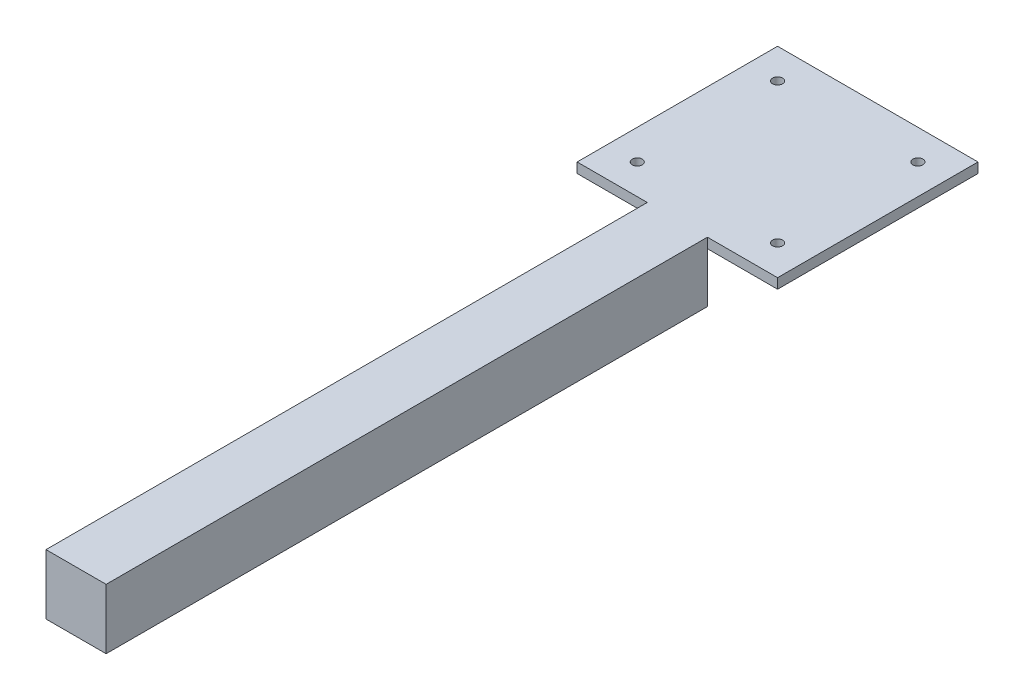
ISO-10303-21;
HEADER;
FILE_DESCRIPTION(('STEP AP214'),'2;1');
FILE_NAME('part.step','',(''),(''),'','','');
FILE_SCHEMA(('AUTOMOTIVE_DESIGN { 1 0 10303 214 1 1 1 1 }'));
ENDSEC;
DATA;
#1=APPLICATION_CONTEXT('core data for automotive mechanical design processes');
#2=APPLICATION_PROTOCOL_DEFINITION('international standard','automotive_design',2000,#1);
#3=PRODUCT_CONTEXT('',#1,'mechanical');
#4=PRODUCT('Part','Part','',(#3));
#5=PRODUCT_RELATED_PRODUCT_CATEGORY('part','',(#4));
#6=PRODUCT_DEFINITION_FORMATION('','',#4);
#7=PRODUCT_DEFINITION_CONTEXT('part definition',#1,'design');
#8=PRODUCT_DEFINITION('design','',#6,#7);
#9=PRODUCT_DEFINITION_SHAPE('','',#8);
#10=(LENGTH_UNIT() NAMED_UNIT(*) SI_UNIT(.MILLI.,.METRE.));
#11=(NAMED_UNIT(*) PLANE_ANGLE_UNIT() SI_UNIT($,.RADIAN.));
#12=(NAMED_UNIT(*) SI_UNIT($,.STERADIAN.) SOLID_ANGLE_UNIT());
#13=UNCERTAINTY_MEASURE_WITH_UNIT(LENGTH_MEASURE(1.E-05),#10,'distance_accuracy_value','');
#14=(GEOMETRIC_REPRESENTATION_CONTEXT(3) GLOBAL_UNCERTAINTY_ASSIGNED_CONTEXT((#13)) GLOBAL_UNIT_ASSIGNED_CONTEXT((#10,
#11,#12)) REPRESENTATION_CONTEXT('',''));
#15=CARTESIAN_POINT('',(0.,0.,0.));
#16=DIRECTION('',(0.,0.,1.));
#17=DIRECTION('',(1.,0.,0.));
#18=AXIS2_PLACEMENT_3D('',#15,#16,#17);
#19=CARTESIAN_POINT('',(-15.,-15.,300.));
#20=DIRECTION('',(1.,0.,0.));
#21=DIRECTION('',(0.,0.,-1.));
#22=AXIS2_PLACEMENT_3D('',#19,#20,#21);
#23=PLANE('',#22);
#24=DIRECTION('',(0.,-1.,0.));
#25=VECTOR('',#24,1.);
#26=CARTESIAN_POINT('',(-15.,-15.,0.));
#27=LINE('',#26,#25);
#28=CARTESIAN_POINT('',(-15.,15.,0.));
#29=VERTEX_POINT('',#28);
#30=CARTESIAN_POINT('',(-15.,9.99999999999999,0.));
#31=VERTEX_POINT('',#30);
#32=EDGE_CURVE('E190',#29,#31,#27,.T.);
#33=ORIENTED_EDGE('',*,*,#32,.T.);
#34=CARTESIAN_POINT('',(-15.,-15.,0.));
#35=VERTEX_POINT('',#34);
#36=EDGE_CURVE('E171',#31,#35,#27,.T.);
#37=ORIENTED_EDGE('',*,*,#36,.T.);
#38=DIRECTION('',(0.,0.,-1.));
#39=VECTOR('',#38,1.);
#40=CARTESIAN_POINT('',(-15.,-15.,300.));
#41=LINE('',#40,#39);
#42=CARTESIAN_POINT('',(-15.,-15.,300.));
#43=VERTEX_POINT('',#42);
#44=EDGE_CURVE('E41',#43,#35,#41,.T.);
#45=ORIENTED_EDGE('',*,*,#44,.F.);
#46=DIRECTION('',(0.,-1.,0.));
#47=VECTOR('',#46,1.);
#48=CARTESIAN_POINT('',(-15.,-15.,300.));
#49=LINE('',#48,#47);
#50=CARTESIAN_POINT('',(-15.,15.,300.));
#51=VERTEX_POINT('',#50);
#52=EDGE_CURVE('E178',#51,#43,#49,.T.);
#53=ORIENTED_EDGE('',*,*,#52,.F.);
#54=DIRECTION('',(0.,0.,-1.));
#55=VECTOR('',#54,1.);
#56=CARTESIAN_POINT('',(-15.,15.,300.));
#57=LINE('',#56,#55);
#58=EDGE_CURVE('E189',#51,#29,#57,.T.);
#59=ORIENTED_EDGE('',*,*,#58,.T.);
#60=EDGE_LOOP('',(#33,#37,#45,#53,#59));
#61=FACE_BOUND('',#60,.T.);
#62=ADVANCED_FACE('F38',(#61),#23,.F.);
#63=CARTESIAN_POINT('',(15.,-15.,300.));
#64=DIRECTION('',(0.,1.,0.));
#65=DIRECTION('',(-1.,0.,0.));
#66=AXIS2_PLACEMENT_3D('',#63,#64,#65);
#67=PLANE('',#66);
#68=DIRECTION('',(1.,0.,0.));
#69=VECTOR('',#68,1.);
#70=CARTESIAN_POINT('',(15.,-15.,0.));
#71=LINE('',#70,#69);
#72=CARTESIAN_POINT('',(15.,-15.,0.));
#73=VERTEX_POINT('',#72);
#74=EDGE_CURVE('E80',#35,#73,#71,.T.);
#75=ORIENTED_EDGE('',*,*,#74,.T.);
#76=DIRECTION('',(0.,0.,-1.));
#77=VECTOR('',#76,1.);
#78=CARTESIAN_POINT('',(15.,-15.,300.));
#79=LINE('',#78,#77);
#80=CARTESIAN_POINT('',(15.,-15.,300.));
#81=VERTEX_POINT('',#80);
#82=EDGE_CURVE('E206',#81,#73,#79,.T.);
#83=ORIENTED_EDGE('',*,*,#82,.F.);
#84=DIRECTION('',(1.,0.,0.));
#85=VECTOR('',#84,1.);
#86=CARTESIAN_POINT('',(15.,-15.,300.));
#87=LINE('',#86,#85);
#88=EDGE_CURVE('E85',#43,#81,#87,.T.);
#89=ORIENTED_EDGE('',*,*,#88,.F.);
#90=ORIENTED_EDGE('',*,*,#44,.T.);
#91=EDGE_LOOP('',(#75,#83,#89,#90));
#92=FACE_BOUND('',#91,.T.);
#93=ADVANCED_FACE('F213',(#92),#67,.F.);
#94=CARTESIAN_POINT('',(15.,-15.,300.));
#95=DIRECTION('',(-1.,0.,0.));
#96=DIRECTION('',(0.,0.,1.));
#97=AXIS2_PLACEMENT_3D('',#94,#95,#96);
#98=PLANE('',#97);
#99=DIRECTION('',(0.,1.,0.));
#100=VECTOR('',#99,1.);
#101=CARTESIAN_POINT('',(15.,-15.,0.));
#102=LINE('',#101,#100);
#103=CARTESIAN_POINT('',(15.,9.99999999999999,0.));
#104=VERTEX_POINT('',#103);
#105=EDGE_CURVE('E181',#73,#104,#102,.T.);
#106=ORIENTED_EDGE('',*,*,#105,.T.);
#107=CARTESIAN_POINT('',(15.,15.,0.));
#108=VERTEX_POINT('',#107);
#109=EDGE_CURVE('E196',#104,#108,#102,.T.);
#110=ORIENTED_EDGE('',*,*,#109,.T.);
#111=DIRECTION('',(0.,0.,-1.));
#112=VECTOR('',#111,1.);
#113=CARTESIAN_POINT('',(15.,15.,300.));
#114=LINE('',#113,#112);
#115=CARTESIAN_POINT('',(15.,15.,300.));
#116=VERTEX_POINT('',#115);
#117=EDGE_CURVE('E203',#116,#108,#114,.T.);
#118=ORIENTED_EDGE('',*,*,#117,.F.);
#119=DIRECTION('',(0.,1.,0.));
#120=VECTOR('',#119,1.);
#121=CARTESIAN_POINT('',(15.,-15.,300.));
#122=LINE('',#121,#120);
#123=EDGE_CURVE('E184',#81,#116,#122,.T.);
#124=ORIENTED_EDGE('',*,*,#123,.F.);
#125=ORIENTED_EDGE('',*,*,#82,.T.);
#126=EDGE_LOOP('',(#106,#110,#118,#124,#125));
#127=FACE_BOUND('',#126,.T.);
#128=ADVANCED_FACE('F220',(#127),#98,.F.);
#129=CARTESIAN_POINT('',(15.,15.,300.));
#130=DIRECTION('',(0.,-1.,0.));
#131=DIRECTION('',(1.,0.,0.));
#132=AXIS2_PLACEMENT_3D('',#129,#130,#131);
#133=PLANE('',#132);
#134=CARTESIAN_POINT('',(35.,15.,-15.));
#135=DIRECTION('',(0.,1.,0.));
#136=DIRECTION('',(1.,0.,0.));
#137=AXIS2_PLACEMENT_3D('',#134,#135,#136);
#138=CIRCLE('',#137,2.5);
#139=CARTESIAN_POINT('',(37.5,15.,-15.));
#140=VERTEX_POINT('',#139);
#141=EDGE_CURVE('E240',#140,#140,#138,.T.);
#142=ORIENTED_EDGE('',*,*,#141,.F.);
#143=EDGE_LOOP('',(#142));
#144=FACE_BOUND('',#143,.T.);
#145=CARTESIAN_POINT('',(-35.,15.,-85.));
#146=DIRECTION('',(0.,1.,0.));
#147=DIRECTION('',(1.,0.,0.));
#148=AXIS2_PLACEMENT_3D('',#145,#146,#147);
#149=CIRCLE('',#148,2.5);
#150=CARTESIAN_POINT('',(-32.5,15.,-85.));
#151=VERTEX_POINT('',#150);
#152=EDGE_CURVE('E247',#151,#151,#149,.T.);
#153=ORIENTED_EDGE('',*,*,#152,.F.);
#154=EDGE_LOOP('',(#153));
#155=FACE_BOUND('',#154,.T.);
#156=CARTESIAN_POINT('',(35.,15.,-85.));
#157=DIRECTION('',(0.,1.,0.));
#158=DIRECTION('',(-1.,0.,0.));
#159=AXIS2_PLACEMENT_3D('',#156,#157,#158);
#160=CIRCLE('',#159,2.5);
#161=CARTESIAN_POINT('',(32.5,15.,-85.));
#162=VERTEX_POINT('',#161);
#163=EDGE_CURVE('E255',#162,#162,#160,.T.);
#164=ORIENTED_EDGE('',*,*,#163,.F.);
#165=EDGE_LOOP('',(#164));
#166=FACE_BOUND('',#165,.T.);
#167=CARTESIAN_POINT('',(-35.,15.,-15.));
#168=DIRECTION('',(0.,1.,0.));
#169=DIRECTION('',(-1.,0.,0.));
#170=AXIS2_PLACEMENT_3D('',#167,#168,#169);
#171=CIRCLE('',#170,2.5);
#172=CARTESIAN_POINT('',(-37.5,15.,-15.));
#173=VERTEX_POINT('',#172);
#174=EDGE_CURVE('E163',#173,#173,#171,.T.);
#175=ORIENTED_EDGE('',*,*,#174,.F.);
#176=EDGE_LOOP('',(#175));
#177=FACE_BOUND('',#176,.T.);
#178=ORIENTED_EDGE('',*,*,#117,.T.);
#179=DIRECTION('',(1.,0.,0.));
#180=VECTOR('',#179,1.);
#181=CARTESIAN_POINT('',(-50.,15.,0.));
#182=LINE('',#181,#180);
#183=CARTESIAN_POINT('',(50.,15.,0.));
#184=VERTEX_POINT('',#183);
#185=EDGE_CURVE('E162',#108,#184,#182,.T.);
#186=ORIENTED_EDGE('',*,*,#185,.T.);
#187=DIRECTION('',(0.,0.,-1.));
#188=VECTOR('',#187,1.);
#189=CARTESIAN_POINT('',(50.,15.,0.));
#190=LINE('',#189,#188);
#191=CARTESIAN_POINT('',(50.,15.,-100.));
#192=VERTEX_POINT('',#191);
#193=EDGE_CURVE('E148',#184,#192,#190,.T.);
#194=ORIENTED_EDGE('',*,*,#193,.T.);
#195=DIRECTION('',(-1.,0.,0.));
#196=VECTOR('',#195,1.);
#197=CARTESIAN_POINT('',(-50.,15.,-100.));
#198=LINE('',#197,#196);
#199=CARTESIAN_POINT('',(-50.,15.,-100.));
#200=VERTEX_POINT('',#199);
#201=EDGE_CURVE('E143',#192,#200,#198,.T.);
#202=ORIENTED_EDGE('',*,*,#201,.T.);
#203=DIRECTION('',(0.,0.,1.));
#204=VECTOR('',#203,1.);
#205=CARTESIAN_POINT('',(-50.,15.,0.));
#206=LINE('',#205,#204);
#207=CARTESIAN_POINT('',(-50.,15.,0.));
#208=VERTEX_POINT('',#207);
#209=EDGE_CURVE('E159',#200,#208,#206,.T.);
#210=ORIENTED_EDGE('',*,*,#209,.T.);
#211=EDGE_CURVE('E124',#208,#29,#182,.T.);
#212=ORIENTED_EDGE('',*,*,#211,.T.);
#213=ORIENTED_EDGE('',*,*,#58,.F.);
#214=DIRECTION('',(-1.,0.,0.));
#215=VECTOR('',#214,1.);
#216=CARTESIAN_POINT('',(15.,15.,300.));
#217=LINE('',#216,#215);
#218=EDGE_CURVE('E64',#116,#51,#217,.T.);
#219=ORIENTED_EDGE('',*,*,#218,.F.);
#220=EDGE_LOOP('',(#178,#186,#194,#202,#210,#212,#213,#219));
#221=FACE_BOUND('',#220,.T.);
#222=ADVANCED_FACE('F225',(#144,#155,#166,#177,#221),#133,.F.);
#223=CARTESIAN_POINT('',(0.,0.,300.));
#224=DIRECTION('',(0.,0.,1.));
#225=DIRECTION('',(1.,0.,0.));
#226=AXIS2_PLACEMENT_3D('',#223,#224,#225);
#227=PLANE('',#226);
#228=ORIENTED_EDGE('',*,*,#52,.T.);
#229=ORIENTED_EDGE('',*,*,#88,.T.);
#230=ORIENTED_EDGE('',*,*,#123,.T.);
#231=ORIENTED_EDGE('',*,*,#218,.T.);
#232=EDGE_LOOP('',(#228,#229,#230,#231));
#233=FACE_BOUND('',#232,.T.);
#234=ADVANCED_FACE('F277',(#233),#227,.T.);
#235=CARTESIAN_POINT('',(0.,0.,0.));
#236=DIRECTION('',(0.,0.,1.));
#237=DIRECTION('',(1.,0.,0.));
#238=AXIS2_PLACEMENT_3D('',#235,#236,#237);
#239=PLANE('',#238);
#240=ORIENTED_EDGE('',*,*,#36,.F.);
#241=DIRECTION('',(1.,0.,0.));
#242=VECTOR('',#241,1.);
#243=CARTESIAN_POINT('',(-50.,9.99999999999999,0.));
#244=LINE('',#243,#242);
#245=EDGE_CURVE('E11',#31,#104,#244,.T.);
#246=ORIENTED_EDGE('',*,*,#245,.T.);
#247=ORIENTED_EDGE('',*,*,#105,.F.);
#248=ORIENTED_EDGE('',*,*,#74,.F.);
#249=EDGE_LOOP('',(#240,#246,#247,#248));
#250=FACE_BOUND('',#249,.T.);
#251=ADVANCED_FACE('F218',(#250),#239,.F.);
#252=CARTESIAN_POINT('',(-50.,9.99999999999999,0.));
#253=DIRECTION('',(0.,0.,1.));
#254=DIRECTION('',(1.,0.,0.));
#255=AXIS2_PLACEMENT_3D('',#252,#253,#254);
#256=PLANE('',#255);
#257=ORIENTED_EDGE('',*,*,#32,.F.);
#258=ORIENTED_EDGE('',*,*,#211,.F.);
#259=DIRECTION('',(0.,1.,0.));
#260=VECTOR('',#259,1.);
#261=CARTESIAN_POINT('',(-50.,9.99999999999999,0.));
#262=LINE('',#261,#260);
#263=CARTESIAN_POINT('',(-50.,9.99999999999999,0.));
#264=VERTEX_POINT('',#263);
#265=EDGE_CURVE('E119',#264,#208,#262,.T.);
#266=ORIENTED_EDGE('',*,*,#265,.F.);
#267=EDGE_CURVE('E48',#264,#31,#244,.T.);
#268=ORIENTED_EDGE('',*,*,#267,.T.);
#269=EDGE_LOOP('',(#257,#258,#266,#268));
#270=FACE_BOUND('',#269,.T.);
#271=ADVANCED_FACE('F121',(#270),#256,.T.);
#272=ORIENTED_EDGE('',*,*,#109,.F.);
#273=CARTESIAN_POINT('',(50.,10.,0.));
#274=VERTEX_POINT('',#273);
#275=EDGE_CURVE('E49',#104,#274,#244,.T.);
#276=ORIENTED_EDGE('',*,*,#275,.T.);
#277=DIRECTION('',(0.,1.,0.));
#278=VECTOR('',#277,1.);
#279=CARTESIAN_POINT('',(50.,10.,0.));
#280=LINE('',#279,#278);
#281=EDGE_CURVE('E130',#274,#184,#280,.T.);
#282=ORIENTED_EDGE('',*,*,#281,.T.);
#283=ORIENTED_EDGE('',*,*,#185,.F.);
#284=EDGE_LOOP('',(#272,#276,#282,#283));
#285=FACE_BOUND('',#284,.T.);
#286=ADVANCED_FACE('F233',(#285),#256,.T.);
#287=CARTESIAN_POINT('',(-50.,9.99999999999999,0.));
#288=DIRECTION('',(-1.,0.,0.));
#289=DIRECTION('',(0.,-1.,0.));
#290=AXIS2_PLACEMENT_3D('',#287,#288,#289);
#291=PLANE('',#290);
#292=ORIENTED_EDGE('',*,*,#209,.F.);
#293=DIRECTION('',(0.,1.,0.));
#294=VECTOR('',#293,1.);
#295=CARTESIAN_POINT('',(-50.,9.99999999999999,-100.));
#296=LINE('',#295,#294);
#297=CARTESIAN_POINT('',(-50.,9.99999999999999,-100.));
#298=VERTEX_POINT('',#297);
#299=EDGE_CURVE('E141',#298,#200,#296,.T.);
#300=ORIENTED_EDGE('',*,*,#299,.F.);
#301=DIRECTION('',(0.,0.,1.));
#302=VECTOR('',#301,1.);
#303=CARTESIAN_POINT('',(-50.,9.99999999999999,0.));
#304=LINE('',#303,#302);
#305=EDGE_CURVE('E136',#298,#264,#304,.T.);
#306=ORIENTED_EDGE('',*,*,#305,.T.);
#307=ORIENTED_EDGE('',*,*,#265,.T.);
#308=EDGE_LOOP('',(#292,#300,#306,#307));
#309=FACE_BOUND('',#308,.T.);
#310=ADVANCED_FACE('F140',(#309),#291,.T.);
#311=CARTESIAN_POINT('',(-50.,9.99999999999999,-100.));
#312=DIRECTION('',(0.,0.,-1.));
#313=DIRECTION('',(-1.,0.,0.));
#314=AXIS2_PLACEMENT_3D('',#311,#312,#313);
#315=PLANE('',#314);
#316=ORIENTED_EDGE('',*,*,#201,.F.);
#317=DIRECTION('',(0.,1.,0.));
#318=VECTOR('',#317,1.);
#319=CARTESIAN_POINT('',(50.,10.,-100.));
#320=LINE('',#319,#318);
#321=CARTESIAN_POINT('',(50.,10.,-100.));
#322=VERTEX_POINT('',#321);
#323=EDGE_CURVE('E172',#322,#192,#320,.T.);
#324=ORIENTED_EDGE('',*,*,#323,.F.);
#325=DIRECTION('',(-1.,0.,0.));
#326=VECTOR('',#325,1.);
#327=CARTESIAN_POINT('',(-50.,9.99999999999999,-100.));
#328=LINE('',#327,#326);
#329=EDGE_CURVE('E131',#322,#298,#328,.T.);
#330=ORIENTED_EDGE('',*,*,#329,.T.);
#331=ORIENTED_EDGE('',*,*,#299,.T.);
#332=EDGE_LOOP('',(#316,#324,#330,#331));
#333=FACE_BOUND('',#332,.T.);
#334=ADVANCED_FACE('F229',(#333),#315,.T.);
#335=CARTESIAN_POINT('',(50.,10.,0.));
#336=DIRECTION('',(1.,0.,0.));
#337=DIRECTION('',(0.,1.,0.));
#338=AXIS2_PLACEMENT_3D('',#335,#336,#337);
#339=PLANE('',#338);
#340=ORIENTED_EDGE('',*,*,#193,.F.);
#341=ORIENTED_EDGE('',*,*,#281,.F.);
#342=DIRECTION('',(0.,0.,-1.));
#343=VECTOR('',#342,1.);
#344=CARTESIAN_POINT('',(50.,10.,0.));
#345=LINE('',#344,#343);
#346=EDGE_CURVE('E139',#274,#322,#345,.T.);
#347=ORIENTED_EDGE('',*,*,#346,.T.);
#348=ORIENTED_EDGE('',*,*,#323,.T.);
#349=EDGE_LOOP('',(#340,#341,#347,#348));
#350=FACE_BOUND('',#349,.T.);
#351=ADVANCED_FACE('F232',(#350),#339,.T.);
#352=CARTESIAN_POINT('',(0.,9.99999999999999,0.));
#353=DIRECTION('',(0.,-1.,0.));
#354=DIRECTION('',(1.,0.,0.));
#355=AXIS2_PLACEMENT_3D('',#352,#353,#354);
#356=PLANE('',#355);
#357=CARTESIAN_POINT('',(35.,10.,-15.));
#358=DIRECTION('',(0.,-1.,0.));
#359=DIRECTION('',(1.,0.,0.));
#360=AXIS2_PLACEMENT_3D('',#357,#358,#359);
#361=CIRCLE('',#360,2.5);
#362=CARTESIAN_POINT('',(37.5,10.,-15.));
#363=VERTEX_POINT('',#362);
#364=EDGE_CURVE('E243',#363,#363,#361,.F.);
#365=ORIENTED_EDGE('',*,*,#364,.T.);
#366=EDGE_LOOP('',(#365));
#367=FACE_BOUND('',#366,.T.);
#368=CARTESIAN_POINT('',(-35.,9.99999999999999,-85.));
#369=DIRECTION('',(0.,-1.,0.));
#370=DIRECTION('',(1.,0.,0.));
#371=AXIS2_PLACEMENT_3D('',#368,#369,#370);
#372=CIRCLE('',#371,2.5);
#373=CARTESIAN_POINT('',(-32.5,9.99999999999999,-85.));
#374=VERTEX_POINT('',#373);
#375=EDGE_CURVE('E251',#374,#374,#372,.F.);
#376=ORIENTED_EDGE('',*,*,#375,.T.);
#377=EDGE_LOOP('',(#376));
#378=FACE_BOUND('',#377,.T.);
#379=CARTESIAN_POINT('',(35.,10.,-85.));
#380=DIRECTION('',(0.,-1.,0.));
#381=DIRECTION('',(1.,0.,0.));
#382=AXIS2_PLACEMENT_3D('',#379,#380,#381);
#383=CIRCLE('',#382,2.5);
#384=CARTESIAN_POINT('',(37.5,10.,-85.));
#385=VERTEX_POINT('',#384);
#386=EDGE_CURVE('E259',#385,#385,#383,.F.);
#387=ORIENTED_EDGE('',*,*,#386,.T.);
#388=EDGE_LOOP('',(#387));
#389=FACE_BOUND('',#388,.T.);
#390=CARTESIAN_POINT('',(-35.,9.99999999999999,-15.));
#391=DIRECTION('',(0.,-1.,0.));
#392=DIRECTION('',(1.,0.,0.));
#393=AXIS2_PLACEMENT_3D('',#390,#391,#392);
#394=CIRCLE('',#393,2.5);
#395=CARTESIAN_POINT('',(-32.5,9.99999999999999,-15.));
#396=VERTEX_POINT('',#395);
#397=EDGE_CURVE('E151',#396,#396,#394,.F.);
#398=ORIENTED_EDGE('',*,*,#397,.T.);
#399=EDGE_LOOP('',(#398));
#400=FACE_BOUND('',#399,.T.);
#401=ORIENTED_EDGE('',*,*,#305,.F.);
#402=ORIENTED_EDGE('',*,*,#329,.F.);
#403=ORIENTED_EDGE('',*,*,#346,.F.);
#404=ORIENTED_EDGE('',*,*,#275,.F.);
#405=ORIENTED_EDGE('',*,*,#245,.F.);
#406=ORIENTED_EDGE('',*,*,#267,.F.);
#407=EDGE_LOOP('',(#401,#402,#403,#404,#405,#406));
#408=FACE_BOUND('',#407,.T.);
#409=ADVANCED_FACE('F134',(#367,#378,#389,#400,#408),#356,.T.);
#410=CARTESIAN_POINT('',(-35.,-15.001,-15.));
#411=DIRECTION('',(0.,1.,0.));
#412=DIRECTION('',(-1.,0.,0.));
#413=AXIS2_PLACEMENT_3D('',#410,#411,#412);
#414=CYLINDRICAL_SURFACE('',#413,2.5);
#415=ORIENTED_EDGE('',*,*,#397,.F.);
#416=EDGE_LOOP('',(#415));
#417=FACE_BOUND('',#416,.T.);
#418=ORIENTED_EDGE('',*,*,#174,.T.);
#419=EDGE_LOOP('',(#418));
#420=FACE_BOUND('',#419,.T.);
#421=ADVANCED_FACE('F271',(#417,#420),#414,.F.);
#422=CARTESIAN_POINT('',(35.,-15.001,-85.));
#423=DIRECTION('',(0.,1.,0.));
#424=DIRECTION('',(-1.,0.,0.));
#425=AXIS2_PLACEMENT_3D('',#422,#423,#424);
#426=CYLINDRICAL_SURFACE('',#425,2.5);
#427=ORIENTED_EDGE('',*,*,#386,.F.);
#428=EDGE_LOOP('',(#427));
#429=FACE_BOUND('',#428,.T.);
#430=ORIENTED_EDGE('',*,*,#163,.T.);
#431=EDGE_LOOP('',(#430));
#432=FACE_BOUND('',#431,.T.);
#433=ADVANCED_FACE('F267',(#429,#432),#426,.F.);
#434=CARTESIAN_POINT('',(-35.,-15.001,-85.));
#435=DIRECTION('',(0.,1.,0.));
#436=DIRECTION('',(-1.,0.,0.));
#437=AXIS2_PLACEMENT_3D('',#434,#435,#436);
#438=CYLINDRICAL_SURFACE('',#437,2.5);
#439=ORIENTED_EDGE('',*,*,#375,.F.);
#440=EDGE_LOOP('',(#439));
#441=FACE_BOUND('',#440,.T.);
#442=ORIENTED_EDGE('',*,*,#152,.T.);
#443=EDGE_LOOP('',(#442));
#444=FACE_BOUND('',#443,.T.);
#445=ADVANCED_FACE('F270',(#441,#444),#438,.F.);
#446=CARTESIAN_POINT('',(35.,-15.001,-15.));
#447=DIRECTION('',(0.,1.,0.));
#448=DIRECTION('',(-1.,0.,0.));
#449=AXIS2_PLACEMENT_3D('',#446,#447,#448);
#450=CYLINDRICAL_SURFACE('',#449,2.5);
#451=ORIENTED_EDGE('',*,*,#364,.F.);
#452=EDGE_LOOP('',(#451));
#453=FACE_BOUND('',#452,.T.);
#454=ORIENTED_EDGE('',*,*,#141,.T.);
#455=EDGE_LOOP('',(#454));
#456=FACE_BOUND('',#455,.T.);
#457=ADVANCED_FACE('F348',(#453,#456),#450,.F.);
#458=CLOSED_SHELL('',(#62,#93,#128,#222,#234,#251,#271,#286,#310,#334,#351,#409,#421,#433,#445,#457));
#459=MANIFOLD_SOLID_BREP('B2',#458);
#460=ADVANCED_BREP_SHAPE_REPRESENTATION('',(#18,#459),#14);
#461=SHAPE_DEFINITION_REPRESENTATION(#9,#460);
ENDSEC;
END-ISO-10303-21;
